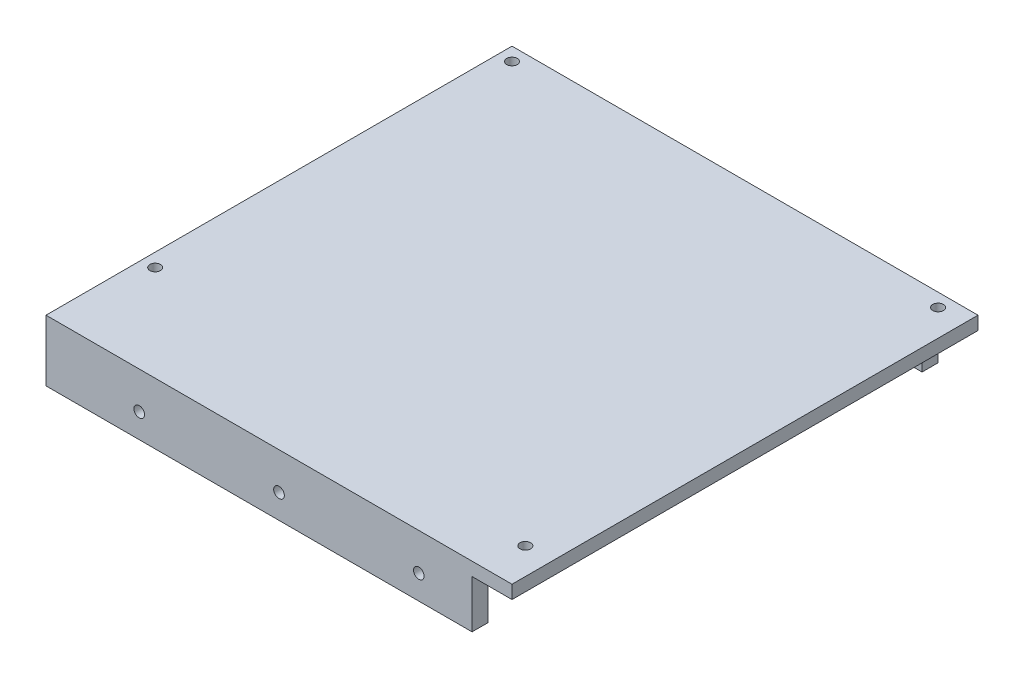
ISO-10303-21;
HEADER;
FILE_DESCRIPTION(('STEP AP214'),'2;1');
FILE_NAME('part.step','',(''),(''),'','','');
FILE_SCHEMA(('AUTOMOTIVE_DESIGN { 1 0 10303 214 1 1 1 1 }'));
ENDSEC;
DATA;
#1=APPLICATION_CONTEXT('core data for automotive mechanical design processes');
#2=APPLICATION_PROTOCOL_DEFINITION('international standard','automotive_design',2000,#1);
#3=PRODUCT_CONTEXT('',#1,'mechanical');
#4=PRODUCT('Part','Part','',(#3));
#5=PRODUCT_RELATED_PRODUCT_CATEGORY('part','',(#4));
#6=PRODUCT_DEFINITION_FORMATION('','',#4);
#7=PRODUCT_DEFINITION_CONTEXT('part definition',#1,'design');
#8=PRODUCT_DEFINITION('design','',#6,#7);
#9=PRODUCT_DEFINITION_SHAPE('','',#8);
#10=(LENGTH_UNIT() NAMED_UNIT(*) SI_UNIT(.MILLI.,.METRE.));
#11=(NAMED_UNIT(*) PLANE_ANGLE_UNIT() SI_UNIT($,.RADIAN.));
#12=(NAMED_UNIT(*) SI_UNIT($,.STERADIAN.) SOLID_ANGLE_UNIT());
#13=UNCERTAINTY_MEASURE_WITH_UNIT(LENGTH_MEASURE(1.E-05),#10,'distance_accuracy_value','');
#14=(GEOMETRIC_REPRESENTATION_CONTEXT(3) GLOBAL_UNCERTAINTY_ASSIGNED_CONTEXT((#13)) GLOBAL_UNIT_ASSIGNED_CONTEXT((#10,
#11,#12)) REPRESENTATION_CONTEXT('',''));
#15=CARTESIAN_POINT('',(0.,0.,0.));
#16=DIRECTION('',(0.,0.,1.));
#17=DIRECTION('',(1.,0.,0.));
#18=AXIS2_PLACEMENT_3D('',#15,#16,#17);
#19=CARTESIAN_POINT('',(-76.5458015267176,-8.90083287186272,114.885496183206));
#20=DIRECTION('',(0.,0.,-1.));
#21=DIRECTION('',(-1.,0.,0.));
#22=AXIS2_PLACEMENT_3D('',#19,#20,#21);
#23=CYLINDRICAL_SURFACE('',#22,2.);
#24=CARTESIAN_POINT('',(-76.5458015267176,-8.90083287186272,-54.1145038167939));
#25=DIRECTION('',(0.,0.,-1.));
#26=DIRECTION('',(-1.,0.,0.));
#27=AXIS2_PLACEMENT_3D('',#24,#25,#26);
#28=CIRCLE('',#27,2.);
#29=CARTESIAN_POINT('',(-78.5458015267176,-8.90083287186272,-54.1145038167939));
#30=VERTEX_POINT('',#29);
#31=EDGE_CURVE('E221',#30,#30,#28,.T.);
#32=ORIENTED_EDGE('',*,*,#31,.F.);
#33=EDGE_LOOP('',(#32));
#34=FACE_BOUND('',#33,.T.);
#35=CARTESIAN_POINT('',(-76.5458015267176,-8.90083287186272,-57.6145038167939));
#36=DIRECTION('',(0.,0.,-1.));
#37=DIRECTION('',(-1.,0.,0.));
#38=AXIS2_PLACEMENT_3D('',#35,#36,#37);
#39=CIRCLE('',#38,2.);
#40=CARTESIAN_POINT('',(-78.5458015267176,-8.90083287186272,-57.6145038167939));
#41=VERTEX_POINT('',#40);
#42=EDGE_CURVE('E41',#41,#41,#39,.F.);
#43=ORIENTED_EDGE('',*,*,#42,.F.);
#44=EDGE_LOOP('',(#43));
#45=FACE_BOUND('',#44,.T.);
#46=ADVANCED_FACE('F37',(#34,#45),#23,.F.);
#47=CARTESIAN_POINT('',(-24.0458015267176,-8.90083287186272,114.885496183206));
#48=DIRECTION('',(0.,0.,-1.));
#49=DIRECTION('',(-1.,0.,0.));
#50=AXIS2_PLACEMENT_3D('',#47,#48,#49);
#51=CYLINDRICAL_SURFACE('',#50,2.);
#52=CARTESIAN_POINT('',(-24.0458015267176,-8.90083287186272,-54.1145038167939));
#53=DIRECTION('',(0.,0.,-1.));
#54=DIRECTION('',(-1.,0.,0.));
#55=AXIS2_PLACEMENT_3D('',#52,#53,#54);
#56=CIRCLE('',#55,2.);
#57=CARTESIAN_POINT('',(-26.0458015267176,-8.90083287186272,-54.1145038167939));
#58=VERTEX_POINT('',#57);
#59=EDGE_CURVE('E226',#58,#58,#56,.T.);
#60=ORIENTED_EDGE('',*,*,#59,.F.);
#61=EDGE_LOOP('',(#60));
#62=FACE_BOUND('',#61,.T.);
#63=CARTESIAN_POINT('',(-24.0458015267176,-8.90083287186272,-57.6145038167939));
#64=DIRECTION('',(0.,0.,-1.));
#65=DIRECTION('',(-1.,0.,0.));
#66=AXIS2_PLACEMENT_3D('',#63,#64,#65);
#67=CIRCLE('',#66,2.);
#68=CARTESIAN_POINT('',(-26.0458015267176,-8.90083287186272,-57.6145038167939));
#69=VERTEX_POINT('',#68);
#70=EDGE_CURVE('E236',#69,#69,#67,.F.);
#71=ORIENTED_EDGE('',*,*,#70,.F.);
#72=EDGE_LOOP('',(#71));
#73=FACE_BOUND('',#72,.T.);
#74=ADVANCED_FACE('F313',(#62,#73),#51,.F.);
#75=CARTESIAN_POINT('',(28.4541984732824,-8.90083287186272,114.885496183206));
#76=DIRECTION('',(0.,0.,-1.));
#77=DIRECTION('',(-1.,0.,0.));
#78=AXIS2_PLACEMENT_3D('',#75,#76,#77);
#79=CYLINDRICAL_SURFACE('',#78,2.);
#80=CARTESIAN_POINT('',(28.4541984732824,-8.90083287186272,-54.1145038167939));
#81=DIRECTION('',(0.,0.,-1.));
#82=DIRECTION('',(-1.,0.,0.));
#83=AXIS2_PLACEMENT_3D('',#80,#81,#82);
#84=CIRCLE('',#83,2.);
#85=CARTESIAN_POINT('',(26.4541984732824,-8.90083287186272,-54.1145038167939));
#86=VERTEX_POINT('',#85);
#87=EDGE_CURVE('E230',#86,#86,#84,.T.);
#88=ORIENTED_EDGE('',*,*,#87,.F.);
#89=EDGE_LOOP('',(#88));
#90=FACE_BOUND('',#89,.T.);
#91=CARTESIAN_POINT('',(28.4541984732824,-8.90083287186272,-57.6145038167939));
#92=DIRECTION('',(0.,0.,-1.));
#93=DIRECTION('',(-1.,0.,0.));
#94=AXIS2_PLACEMENT_3D('',#91,#92,#93);
#95=CIRCLE('',#94,2.);
#96=CARTESIAN_POINT('',(26.4541984732824,-8.90083287186272,-57.6145038167939));
#97=VERTEX_POINT('',#96);
#98=EDGE_CURVE('E234',#97,#97,#95,.F.);
#99=ORIENTED_EDGE('',*,*,#98,.F.);
#100=EDGE_LOOP('',(#99));
#101=FACE_BOUND('',#100,.T.);
#102=ADVANCED_FACE('F320',(#90,#101),#79,.F.);
#103=CARTESIAN_POINT('',(0.,0.,0.));
#104=DIRECTION('',(0.,1.,0.));
#105=DIRECTION('',(0.,0.,1.));
#106=AXIS2_PLACEMENT_3D('',#103,#104,#105);
#107=PLANE('',#106);
#108=CARTESIAN_POINT('',(-106.545801526718,0.,78.8854961832061));
#109=DIRECTION('',(0.,1.,0.));
#110=DIRECTION('',(0.,0.,1.));
#111=AXIS2_PLACEMENT_3D('',#108,#109,#110);
#112=CIRCLE('',#111,2.);
#113=CARTESIAN_POINT('',(-106.545801526718,0.,80.8854961832061));
#114=VERTEX_POINT('',#113);
#115=EDGE_CURVE('E185',#114,#114,#112,.T.);
#116=ORIENTED_EDGE('',*,*,#115,.T.);
#117=EDGE_LOOP('',(#116));
#118=FACE_BOUND('',#117,.T.);
#119=CARTESIAN_POINT('',(53.4541984732824,0.,99.8854961832061));
#120=DIRECTION('',(0.,1.,0.));
#121=DIRECTION('',(0.,0.,1.));
#122=AXIS2_PLACEMENT_3D('',#119,#120,#121);
#123=CIRCLE('',#122,2.);
#124=CARTESIAN_POINT('',(53.4541984732824,0.,101.885496183206));
#125=VERTEX_POINT('',#124);
#126=EDGE_CURVE('E179',#125,#125,#123,.T.);
#127=ORIENTED_EDGE('',*,*,#126,.T.);
#128=EDGE_LOOP('',(#127));
#129=FACE_BOUND('',#128,.T.);
#130=CARTESIAN_POINT('',(53.4541984732824,0.,-55.1145038167939));
#131=DIRECTION('',(0.,1.,0.));
#132=DIRECTION('',(0.,0.,1.));
#133=AXIS2_PLACEMENT_3D('',#130,#131,#132);
#134=CIRCLE('',#133,2.);
#135=CARTESIAN_POINT('',(53.4541984732824,0.,-53.1145038167939));
#136=VERTEX_POINT('',#135);
#137=EDGE_CURVE('E172',#136,#136,#134,.T.);
#138=ORIENTED_EDGE('',*,*,#137,.T.);
#139=EDGE_LOOP('',(#138));
#140=FACE_BOUND('',#139,.T.);
#141=CARTESIAN_POINT('',(-106.545801526718,0.,-55.1145038167939));
#142=DIRECTION('',(0.,1.,0.));
#143=DIRECTION('',(0.,0.,1.));
#144=AXIS2_PLACEMENT_3D('',#141,#142,#143);
#145=CIRCLE('',#144,2.);
#146=CARTESIAN_POINT('',(-106.545801526718,0.,-53.1145038167939));
#147=VERTEX_POINT('',#146);
#148=EDGE_CURVE('E190',#147,#147,#145,.T.);
#149=ORIENTED_EDGE('',*,*,#148,.T.);
#150=EDGE_LOOP('',(#149));
#151=FACE_BOUND('',#150,.T.);
#152=DIRECTION('',(0.,0.,-1.));
#153=VECTOR('',#152,1.);
#154=CARTESIAN_POINT('',(-96.5458015267176,0.,-60.1145038167939));
#155=LINE('',#154,#153);
#156=CARTESIAN_POINT('',(-96.5458015267176,0.,-54.1145038167939));
#157=VERTEX_POINT('',#156);
#158=CARTESIAN_POINT('',(-96.5458015267176,0.,-60.1145038167939));
#159=VERTEX_POINT('',#158);
#160=EDGE_CURVE('E54',#157,#159,#155,.T.);
#161=ORIENTED_EDGE('',*,*,#160,.F.);
#162=DIRECTION('',(-1.,0.,0.));
#163=VECTOR('',#162,1.);
#164=CARTESIAN_POINT('',(-96.5458015267176,0.,-54.1145038167939));
#165=LINE('',#164,#163);
#166=CARTESIAN_POINT('',(48.4541984732824,0.,-54.1145038167939));
#167=VERTEX_POINT('',#166);
#168=EDGE_CURVE('E139',#167,#157,#165,.T.);
#169=ORIENTED_EDGE('',*,*,#168,.F.);
#170=DIRECTION('',(0.,0.,1.));
#171=VECTOR('',#170,1.);
#172=CARTESIAN_POINT('',(48.4541984732824,0.,-60.1145038167939));
#173=LINE('',#172,#171);
#174=CARTESIAN_POINT('',(48.4541984732824,0.,-60.1145038167939));
#175=VERTEX_POINT('',#174);
#176=EDGE_CURVE('E264',#175,#167,#173,.T.);
#177=ORIENTED_EDGE('',*,*,#176,.F.);
#178=DIRECTION('',(-1.,0.,0.));
#179=VECTOR('',#178,1.);
#180=CARTESIAN_POINT('',(-111.545801526718,0.,-60.1145038167939));
#181=LINE('',#180,#179);
#182=CARTESIAN_POINT('',(63.4541984732824,0.,-60.1145038167939));
#183=VERTEX_POINT('',#182);
#184=EDGE_CURVE('E200',#183,#175,#181,.T.);
#185=ORIENTED_EDGE('',*,*,#184,.F.);
#186=DIRECTION('',(0.,0.,-1.));
#187=VECTOR('',#186,1.);
#188=CARTESIAN_POINT('',(63.4541984732824,0.,-60.1145038167939));
#189=LINE('',#188,#187);
#190=CARTESIAN_POINT('',(63.4541984732824,0.,114.885496183206));
#191=VERTEX_POINT('',#190);
#192=EDGE_CURVE('E210',#191,#183,#189,.T.);
#193=ORIENTED_EDGE('',*,*,#192,.F.);
#194=DIRECTION('',(1.,0.,0.));
#195=VECTOR('',#194,1.);
#196=CARTESIAN_POINT('',(-111.545801526718,0.,114.885496183206));
#197=LINE('',#196,#195);
#198=CARTESIAN_POINT('',(48.4541984732824,0.,114.885496183206));
#199=VERTEX_POINT('',#198);
#200=EDGE_CURVE('E62',#199,#191,#197,.T.);
#201=ORIENTED_EDGE('',*,*,#200,.F.);
#202=DIRECTION('',(0.,0.,1.));
#203=VECTOR('',#202,1.);
#204=CARTESIAN_POINT('',(48.4541984732824,0.,114.885496183206));
#205=LINE('',#204,#203);
#206=CARTESIAN_POINT('',(48.4541984732824,0.,108.885496183206));
#207=VERTEX_POINT('',#206);
#208=EDGE_CURVE('E145',#207,#199,#205,.T.);
#209=ORIENTED_EDGE('',*,*,#208,.F.);
#210=DIRECTION('',(1.,0.,0.));
#211=VECTOR('',#210,1.);
#212=CARTESIAN_POINT('',(-111.545801526718,0.,108.885496183206));
#213=LINE('',#212,#211);
#214=CARTESIAN_POINT('',(-111.545801526718,0.,108.885496183206));
#215=VERTEX_POINT('',#214);
#216=EDGE_CURVE('E142',#215,#207,#213,.T.);
#217=ORIENTED_EDGE('',*,*,#216,.F.);
#218=DIRECTION('',(0.,0.,1.));
#219=VECTOR('',#218,1.);
#220=CARTESIAN_POINT('',(-111.545801526718,0.,-60.1145038167939));
#221=LINE('',#220,#219);
#222=CARTESIAN_POINT('',(-111.545801526718,0.,-60.1145038167939));
#223=VERTEX_POINT('',#222);
#224=EDGE_CURVE('E193',#223,#215,#221,.T.);
#225=ORIENTED_EDGE('',*,*,#224,.F.);
#226=EDGE_CURVE('E212',#159,#223,#181,.T.);
#227=ORIENTED_EDGE('',*,*,#226,.F.);
#228=EDGE_LOOP('',(#161,#169,#177,#185,#193,#201,#209,#217,#225,#227));
#229=FACE_BOUND('',#228,.T.);
#230=ADVANCED_FACE('F274',(#118,#129,#140,#151,#229),#107,.F.);
#231=CARTESIAN_POINT('',(-111.545801526718,5.,-60.1145038167939));
#232=DIRECTION('',(1.,0.,0.));
#233=DIRECTION('',(0.,0.,-1.));
#234=AXIS2_PLACEMENT_3D('',#231,#232,#233);
#235=PLANE('',#234);
#236=ORIENTED_EDGE('',*,*,#224,.T.);
#237=DIRECTION('',(0.,1.,0.));
#238=VECTOR('',#237,1.);
#239=CARTESIAN_POINT('',(-111.545801526718,-18.,108.885496183206));
#240=LINE('',#239,#238);
#241=CARTESIAN_POINT('',(-111.545801526718,-18.,108.885496183206));
#242=VERTEX_POINT('',#241);
#243=EDGE_CURVE('E168',#242,#215,#240,.T.);
#244=ORIENTED_EDGE('',*,*,#243,.F.);
#245=DIRECTION('',(0.,0.,-1.));
#246=VECTOR('',#245,1.);
#247=CARTESIAN_POINT('',(-111.545801526718,-18.,114.885496183206));
#248=LINE('',#247,#246);
#249=CARTESIAN_POINT('',(-111.545801526718,-18.,114.885496183206));
#250=VERTEX_POINT('',#249);
#251=EDGE_CURVE('E151',#250,#242,#248,.T.);
#252=ORIENTED_EDGE('',*,*,#251,.F.);
#253=DIRECTION('',(0.,-1.,0.));
#254=VECTOR('',#253,1.);
#255=CARTESIAN_POINT('',(-111.545801526718,5.,114.885496183206));
#256=LINE('',#255,#254);
#257=CARTESIAN_POINT('',(-111.545801526718,5.,114.885496183206));
#258=VERTEX_POINT('',#257);
#259=EDGE_CURVE('E11',#258,#250,#256,.T.);
#260=ORIENTED_EDGE('',*,*,#259,.F.);
#261=DIRECTION('',(0.,0.,1.));
#262=VECTOR('',#261,1.);
#263=CARTESIAN_POINT('',(-111.545801526718,5.,-60.1145038167939));
#264=LINE('',#263,#262);
#265=CARTESIAN_POINT('',(-111.545801526718,5.,-60.1145038167939));
#266=VERTEX_POINT('',#265);
#267=EDGE_CURVE('E196',#266,#258,#264,.T.);
#268=ORIENTED_EDGE('',*,*,#267,.F.);
#269=DIRECTION('',(0.,-1.,0.));
#270=VECTOR('',#269,1.);
#271=CARTESIAN_POINT('',(-111.545801526718,5.,-60.1145038167939));
#272=LINE('',#271,#270);
#273=EDGE_CURVE('E206',#266,#223,#272,.T.);
#274=ORIENTED_EDGE('',*,*,#273,.T.);
#275=EDGE_LOOP('',(#236,#244,#252,#260,#268,#274));
#276=FACE_BOUND('',#275,.T.);
#277=ADVANCED_FACE('F39',(#276),#235,.F.);
#278=CARTESIAN_POINT('',(-111.545801526718,5.,114.885496183206));
#279=DIRECTION('',(0.,0.,-1.));
#280=DIRECTION('',(-1.,0.,0.));
#281=AXIS2_PLACEMENT_3D('',#278,#279,#280);
#282=PLANE('',#281);
#283=CARTESIAN_POINT('',(28.4541984732824,-8.90083287186272,114.885496183206));
#284=DIRECTION('',(0.,0.,-1.));
#285=DIRECTION('',(-1.,0.,0.));
#286=AXIS2_PLACEMENT_3D('',#283,#284,#285);
#287=CIRCLE('',#286,2.);
#288=CARTESIAN_POINT('',(26.4541984732824,-8.90083287186272,114.885496183206));
#289=VERTEX_POINT('',#288);
#290=EDGE_CURVE('E225',#289,#289,#287,.T.);
#291=ORIENTED_EDGE('',*,*,#290,.T.);
#292=EDGE_LOOP('',(#291));
#293=FACE_BOUND('',#292,.T.);
#294=CARTESIAN_POINT('',(-24.0458015267176,-8.90083287186272,114.885496183206));
#295=DIRECTION('',(0.,0.,-1.));
#296=DIRECTION('',(-1.,0.,0.));
#297=AXIS2_PLACEMENT_3D('',#294,#295,#296);
#298=CIRCLE('',#297,2.);
#299=CARTESIAN_POINT('',(-26.0458015267176,-8.90083287186272,114.885496183206));
#300=VERTEX_POINT('',#299);
#301=EDGE_CURVE('E246',#300,#300,#298,.T.);
#302=ORIENTED_EDGE('',*,*,#301,.T.);
#303=EDGE_LOOP('',(#302));
#304=FACE_BOUND('',#303,.T.);
#305=CARTESIAN_POINT('',(-76.5458015267176,-8.90083287186272,114.885496183206));
#306=DIRECTION('',(0.,0.,-1.));
#307=DIRECTION('',(-1.,0.,0.));
#308=AXIS2_PLACEMENT_3D('',#305,#306,#307);
#309=CIRCLE('',#308,2.);
#310=CARTESIAN_POINT('',(-78.5458015267176,-8.90083287186272,114.885496183206));
#311=VERTEX_POINT('',#310);
#312=EDGE_CURVE('E242',#311,#311,#309,.T.);
#313=ORIENTED_EDGE('',*,*,#312,.T.);
#314=EDGE_LOOP('',(#313));
#315=FACE_BOUND('',#314,.T.);
#316=ORIENTED_EDGE('',*,*,#259,.T.);
#317=DIRECTION('',(-1.,0.,0.));
#318=VECTOR('',#317,1.);
#319=CARTESIAN_POINT('',(-111.545801526718,-18.,114.885496183206));
#320=LINE('',#319,#318);
#321=CARTESIAN_POINT('',(48.4541984732824,-18.,114.885496183206));
#322=VERTEX_POINT('',#321);
#323=EDGE_CURVE('E158',#322,#250,#320,.T.);
#324=ORIENTED_EDGE('',*,*,#323,.F.);
#325=DIRECTION('',(0.,1.,0.));
#326=VECTOR('',#325,1.);
#327=CARTESIAN_POINT('',(48.4541984732824,-18.,114.885496183206));
#328=LINE('',#327,#326);
#329=EDGE_CURVE('E160',#322,#199,#328,.T.);
#330=ORIENTED_EDGE('',*,*,#329,.T.);
#331=ORIENTED_EDGE('',*,*,#200,.T.);
#332=DIRECTION('',(0.,-1.,0.));
#333=VECTOR('',#332,1.);
#334=CARTESIAN_POINT('',(63.4541984732824,5.,114.885496183206));
#335=LINE('',#334,#333);
#336=CARTESIAN_POINT('',(63.4541984732824,5.,114.885496183206));
#337=VERTEX_POINT('',#336);
#338=EDGE_CURVE('E46',#337,#191,#335,.T.);
#339=ORIENTED_EDGE('',*,*,#338,.F.);
#340=DIRECTION('',(1.,0.,0.));
#341=VECTOR('',#340,1.);
#342=CARTESIAN_POINT('',(-111.545801526718,5.,114.885496183206));
#343=LINE('',#342,#341);
#344=EDGE_CURVE('E199',#258,#337,#343,.T.);
#345=ORIENTED_EDGE('',*,*,#344,.F.);
#346=EDGE_LOOP('',(#316,#324,#330,#331,#339,#345));
#347=FACE_BOUND('',#346,.T.);
#348=ADVANCED_FACE('F292',(#293,#304,#315,#347),#282,.F.);
#349=CARTESIAN_POINT('',(63.4541984732824,5.,-60.1145038167939));
#350=DIRECTION('',(-1.,0.,0.));
#351=DIRECTION('',(0.,0.,1.));
#352=AXIS2_PLACEMENT_3D('',#349,#350,#351);
#353=PLANE('',#352);
#354=ORIENTED_EDGE('',*,*,#192,.T.);
#355=DIRECTION('',(0.,-1.,0.));
#356=VECTOR('',#355,1.);
#357=CARTESIAN_POINT('',(63.4541984732824,5.,-60.1145038167939));
#358=LINE('',#357,#356);
#359=CARTESIAN_POINT('',(63.4541984732824,5.,-60.1145038167939));
#360=VERTEX_POINT('',#359);
#361=EDGE_CURVE('E216',#360,#183,#358,.T.);
#362=ORIENTED_EDGE('',*,*,#361,.F.);
#363=DIRECTION('',(0.,0.,-1.));
#364=VECTOR('',#363,1.);
#365=CARTESIAN_POINT('',(63.4541984732824,5.,-60.1145038167939));
#366=LINE('',#365,#364);
#367=EDGE_CURVE('E202',#337,#360,#366,.T.);
#368=ORIENTED_EDGE('',*,*,#367,.F.);
#369=ORIENTED_EDGE('',*,*,#338,.T.);
#370=EDGE_LOOP('',(#354,#362,#368,#369));
#371=FACE_BOUND('',#370,.T.);
#372=ADVANCED_FACE('F290',(#371),#353,.F.);
#373=CARTESIAN_POINT('',(-111.545801526718,5.,-60.1145038167939));
#374=DIRECTION('',(0.,0.,1.));
#375=DIRECTION('',(1.,0.,0.));
#376=AXIS2_PLACEMENT_3D('',#373,#374,#375);
#377=PLANE('',#376);
#378=CARTESIAN_POINT('',(28.4541984732824,-8.90083287186272,-60.1145038167939));
#379=DIRECTION('',(0.,0.,-1.));
#380=DIRECTION('',(-1.,0.,0.));
#381=AXIS2_PLACEMENT_3D('',#378,#379,#380);
#382=CIRCLE('',#381,5.);
#383=CARTESIAN_POINT('',(23.4541984732824,-8.90083287186272,-60.1145038167939));
#384=VERTEX_POINT('',#383);
#385=EDGE_CURVE('E396',#384,#384,#382,.T.);
#386=ORIENTED_EDGE('',*,*,#385,.F.);
#387=EDGE_LOOP('',(#386));
#388=FACE_BOUND('',#387,.T.);
#389=CARTESIAN_POINT('',(-24.0458015267176,-8.90083287186272,-60.1145038167939));
#390=DIRECTION('',(0.,0.,-1.));
#391=DIRECTION('',(-1.,0.,0.));
#392=AXIS2_PLACEMENT_3D('',#389,#390,#391);
#393=CIRCLE('',#392,5.);
#394=CARTESIAN_POINT('',(-29.0458015267176,-8.90083287186272,-60.1145038167939));
#395=VERTEX_POINT('',#394);
#396=EDGE_CURVE('E390',#395,#395,#393,.T.);
#397=ORIENTED_EDGE('',*,*,#396,.F.);
#398=EDGE_LOOP('',(#397));
#399=FACE_BOUND('',#398,.T.);
#400=CARTESIAN_POINT('',(-76.5458015267176,-8.90083287186272,-60.1145038167939));
#401=DIRECTION('',(0.,0.,-1.));
#402=DIRECTION('',(-1.,0.,0.));
#403=AXIS2_PLACEMENT_3D('',#400,#401,#402);
#404=CIRCLE('',#403,5.);
#405=CARTESIAN_POINT('',(-81.5458015267176,-8.90083287186272,-60.1145038167939));
#406=VERTEX_POINT('',#405);
#407=EDGE_CURVE('E384',#406,#406,#404,.T.);
#408=ORIENTED_EDGE('',*,*,#407,.F.);
#409=EDGE_LOOP('',(#408));
#410=FACE_BOUND('',#409,.T.);
#411=ORIENTED_EDGE('',*,*,#184,.T.);
#412=DIRECTION('',(0.,1.,0.));
#413=VECTOR('',#412,1.);
#414=CARTESIAN_POINT('',(48.4541984732824,-18.,-60.1145038167939));
#415=LINE('',#414,#413);
#416=CARTESIAN_POINT('',(48.4541984732824,-18.,-60.1145038167939));
#417=VERTEX_POINT('',#416);
#418=EDGE_CURVE('E128',#417,#175,#415,.T.);
#419=ORIENTED_EDGE('',*,*,#418,.F.);
#420=DIRECTION('',(1.,0.,0.));
#421=VECTOR('',#420,1.);
#422=CARTESIAN_POINT('',(-96.5458015267176,-18.,-60.1145038167939));
#423=LINE('',#422,#421);
#424=CARTESIAN_POINT('',(-96.5458015267176,-18.,-60.1145038167939));
#425=VERTEX_POINT('',#424);
#426=EDGE_CURVE('E122',#425,#417,#423,.T.);
#427=ORIENTED_EDGE('',*,*,#426,.F.);
#428=DIRECTION('',(0.,1.,0.));
#429=VECTOR('',#428,1.);
#430=CARTESIAN_POINT('',(-96.5458015267176,-18.,-60.1145038167939));
#431=LINE('',#430,#429);
#432=EDGE_CURVE('E126',#425,#159,#431,.T.);
#433=ORIENTED_EDGE('',*,*,#432,.T.);
#434=ORIENTED_EDGE('',*,*,#226,.T.);
#435=ORIENTED_EDGE('',*,*,#273,.F.);
#436=DIRECTION('',(-1.,0.,0.));
#437=VECTOR('',#436,1.);
#438=CARTESIAN_POINT('',(-111.545801526718,5.,-60.1145038167939));
#439=LINE('',#438,#437);
#440=EDGE_CURVE('E204',#360,#266,#439,.T.);
#441=ORIENTED_EDGE('',*,*,#440,.F.);
#442=ORIENTED_EDGE('',*,*,#361,.T.);
#443=EDGE_LOOP('',(#411,#419,#427,#433,#434,#435,#441,#442));
#444=FACE_BOUND('',#443,.T.);
#445=ADVANCED_FACE('F125',(#388,#399,#410,#444),#377,.F.);
#446=CARTESIAN_POINT('',(0.,5.,0.));
#447=DIRECTION('',(0.,1.,0.));
#448=DIRECTION('',(0.,0.,1.));
#449=AXIS2_PLACEMENT_3D('',#446,#447,#448);
#450=PLANE('',#449);
#451=CARTESIAN_POINT('',(-106.545801526718,5.,78.8854961832061));
#452=DIRECTION('',(0.,1.,0.));
#453=DIRECTION('',(0.,0.,1.));
#454=AXIS2_PLACEMENT_3D('',#451,#452,#453);
#455=CIRCLE('',#454,2.);
#456=CARTESIAN_POINT('',(-106.545801526718,5.,80.8854961832061));
#457=VERTEX_POINT('',#456);
#458=EDGE_CURVE('E171',#457,#457,#455,.T.);
#459=ORIENTED_EDGE('',*,*,#458,.F.);
#460=EDGE_LOOP('',(#459));
#461=FACE_BOUND('',#460,.T.);
#462=CARTESIAN_POINT('',(53.4541984732824,5.,99.8854961832061));
#463=DIRECTION('',(0.,1.,0.));
#464=DIRECTION('',(0.,0.,1.));
#465=AXIS2_PLACEMENT_3D('',#462,#463,#464);
#466=CIRCLE('',#465,2.);
#467=CARTESIAN_POINT('',(53.4541984732824,5.,101.885496183206));
#468=VERTEX_POINT('',#467);
#469=EDGE_CURVE('E182',#468,#468,#466,.T.);
#470=ORIENTED_EDGE('',*,*,#469,.F.);
#471=EDGE_LOOP('',(#470));
#472=FACE_BOUND('',#471,.T.);
#473=CARTESIAN_POINT('',(53.4541984732824,5.,-55.1145038167939));
#474=DIRECTION('',(0.,1.,0.));
#475=DIRECTION('',(0.,0.,1.));
#476=AXIS2_PLACEMENT_3D('',#473,#474,#475);
#477=CIRCLE('',#476,2.);
#478=CARTESIAN_POINT('',(53.4541984732824,5.,-53.1145038167939));
#479=VERTEX_POINT('',#478);
#480=EDGE_CURVE('E176',#479,#479,#477,.T.);
#481=ORIENTED_EDGE('',*,*,#480,.F.);
#482=EDGE_LOOP('',(#481));
#483=FACE_BOUND('',#482,.T.);
#484=CARTESIAN_POINT('',(-106.545801526718,5.,-55.1145038167939));
#485=DIRECTION('',(0.,1.,0.));
#486=DIRECTION('',(0.,0.,1.));
#487=AXIS2_PLACEMENT_3D('',#484,#485,#486);
#488=CIRCLE('',#487,2.);
#489=CARTESIAN_POINT('',(-106.545801526718,5.,-53.1145038167939));
#490=VERTEX_POINT('',#489);
#491=EDGE_CURVE('E175',#490,#490,#488,.T.);
#492=ORIENTED_EDGE('',*,*,#491,.F.);
#493=EDGE_LOOP('',(#492));
#494=FACE_BOUND('',#493,.T.);
#495=ORIENTED_EDGE('',*,*,#267,.T.);
#496=ORIENTED_EDGE('',*,*,#344,.T.);
#497=ORIENTED_EDGE('',*,*,#367,.T.);
#498=ORIENTED_EDGE('',*,*,#440,.T.);
#499=EDGE_LOOP('',(#495,#496,#497,#498));
#500=FACE_BOUND('',#499,.T.);
#501=ADVANCED_FACE('F285',(#461,#472,#483,#494,#500),#450,.T.);
#502=CARTESIAN_POINT('',(-106.545801526718,0.,-55.1145038167939));
#503=DIRECTION('',(0.,1.,0.));
#504=DIRECTION('',(0.,0.,1.));
#505=AXIS2_PLACEMENT_3D('',#502,#503,#504);
#506=CYLINDRICAL_SURFACE('',#505,2.);
#507=ORIENTED_EDGE('',*,*,#148,.F.);
#508=EDGE_LOOP('',(#507));
#509=FACE_BOUND('',#508,.T.);
#510=ORIENTED_EDGE('',*,*,#491,.T.);
#511=EDGE_LOOP('',(#510));
#512=FACE_BOUND('',#511,.T.);
#513=ADVANCED_FACE('F353',(#509,#512),#506,.F.);
#514=CARTESIAN_POINT('',(53.4541984732824,0.,-55.1145038167939));
#515=DIRECTION('',(0.,1.,0.));
#516=DIRECTION('',(0.,0.,1.));
#517=AXIS2_PLACEMENT_3D('',#514,#515,#516);
#518=CYLINDRICAL_SURFACE('',#517,2.);
#519=ORIENTED_EDGE('',*,*,#137,.F.);
#520=EDGE_LOOP('',(#519));
#521=FACE_BOUND('',#520,.T.);
#522=ORIENTED_EDGE('',*,*,#480,.T.);
#523=EDGE_LOOP('',(#522));
#524=FACE_BOUND('',#523,.T.);
#525=ADVANCED_FACE('F350',(#521,#524),#518,.F.);
#526=CARTESIAN_POINT('',(53.4541984732824,0.,99.8854961832061));
#527=DIRECTION('',(0.,1.,0.));
#528=DIRECTION('',(0.,0.,1.));
#529=AXIS2_PLACEMENT_3D('',#526,#527,#528);
#530=CYLINDRICAL_SURFACE('',#529,2.);
#531=ORIENTED_EDGE('',*,*,#126,.F.);
#532=EDGE_LOOP('',(#531));
#533=FACE_BOUND('',#532,.T.);
#534=ORIENTED_EDGE('',*,*,#469,.T.);
#535=EDGE_LOOP('',(#534));
#536=FACE_BOUND('',#535,.T.);
#537=ADVANCED_FACE('F345',(#533,#536),#530,.F.);
#538=CARTESIAN_POINT('',(-106.545801526718,0.,78.8854961832061));
#539=DIRECTION('',(0.,1.,0.));
#540=DIRECTION('',(0.,0.,1.));
#541=AXIS2_PLACEMENT_3D('',#538,#539,#540);
#542=CYLINDRICAL_SURFACE('',#541,2.);
#543=ORIENTED_EDGE('',*,*,#115,.F.);
#544=EDGE_LOOP('',(#543));
#545=FACE_BOUND('',#544,.T.);
#546=ORIENTED_EDGE('',*,*,#458,.T.);
#547=EDGE_LOOP('',(#546));
#548=FACE_BOUND('',#547,.T.);
#549=ADVANCED_FACE('F339',(#545,#548),#542,.F.);
#550=CARTESIAN_POINT('',(-111.545801526718,-18.,108.885496183206));
#551=DIRECTION('',(0.,0.,1.));
#552=DIRECTION('',(1.,0.,0.));
#553=AXIS2_PLACEMENT_3D('',#550,#551,#552);
#554=PLANE('',#553);
#555=CARTESIAN_POINT('',(28.4541984732824,-8.90083287186272,108.885496183206));
#556=DIRECTION('',(0.,0.,1.));
#557=DIRECTION('',(1.,0.,0.));
#558=AXIS2_PLACEMENT_3D('',#555,#556,#557);
#559=CIRCLE('',#558,2.);
#560=CARTESIAN_POINT('',(30.4541984732824,-8.90083287186272,108.885496183206));
#561=VERTEX_POINT('',#560);
#562=EDGE_CURVE('E233',#561,#561,#559,.T.);
#563=ORIENTED_EDGE('',*,*,#562,.T.);
#564=EDGE_LOOP('',(#563));
#565=FACE_BOUND('',#564,.T.);
#566=CARTESIAN_POINT('',(-24.0458015267176,-8.90083287186272,108.885496183206));
#567=DIRECTION('',(0.,0.,1.));
#568=DIRECTION('',(1.,0.,0.));
#569=AXIS2_PLACEMENT_3D('',#566,#567,#568);
#570=CIRCLE('',#569,2.);
#571=CARTESIAN_POINT('',(-22.0458015267176,-8.90083287186272,108.885496183206));
#572=VERTEX_POINT('',#571);
#573=EDGE_CURVE('E229',#572,#572,#570,.T.);
#574=ORIENTED_EDGE('',*,*,#573,.T.);
#575=EDGE_LOOP('',(#574));
#576=FACE_BOUND('',#575,.T.);
#577=CARTESIAN_POINT('',(-76.5458015267176,-8.90083287186272,108.885496183206));
#578=DIRECTION('',(0.,0.,1.));
#579=DIRECTION('',(1.,0.,0.));
#580=AXIS2_PLACEMENT_3D('',#577,#578,#579);
#581=CIRCLE('',#580,2.);
#582=CARTESIAN_POINT('',(-74.5458015267176,-8.90083287186272,108.885496183206));
#583=VERTEX_POINT('',#582);
#584=EDGE_CURVE('E224',#583,#583,#581,.T.);
#585=ORIENTED_EDGE('',*,*,#584,.T.);
#586=EDGE_LOOP('',(#585));
#587=FACE_BOUND('',#586,.T.);
#588=ORIENTED_EDGE('',*,*,#216,.T.);
#589=DIRECTION('',(0.,1.,0.));
#590=VECTOR('',#589,1.);
#591=CARTESIAN_POINT('',(48.4541984732824,-18.,108.885496183206));
#592=LINE('',#591,#590);
#593=CARTESIAN_POINT('',(48.4541984732824,-18.,108.885496183206));
#594=VERTEX_POINT('',#593);
#595=EDGE_CURVE('E165',#594,#207,#592,.T.);
#596=ORIENTED_EDGE('',*,*,#595,.F.);
#597=DIRECTION('',(1.,0.,0.));
#598=VECTOR('',#597,1.);
#599=CARTESIAN_POINT('',(-111.545801526718,-18.,108.885496183206));
#600=LINE('',#599,#598);
#601=EDGE_CURVE('E154',#242,#594,#600,.T.);
#602=ORIENTED_EDGE('',*,*,#601,.F.);
#603=ORIENTED_EDGE('',*,*,#243,.T.);
#604=EDGE_LOOP('',(#588,#596,#602,#603));
#605=FACE_BOUND('',#604,.T.);
#606=ADVANCED_FACE('F300',(#565,#576,#587,#605),#554,.F.);
#607=CARTESIAN_POINT('',(48.4541984732824,-18.,114.885496183206));
#608=DIRECTION('',(-1.,0.,0.));
#609=DIRECTION('',(0.,0.,1.));
#610=AXIS2_PLACEMENT_3D('',#607,#608,#609);
#611=PLANE('',#610);
#612=ORIENTED_EDGE('',*,*,#208,.T.);
#613=ORIENTED_EDGE('',*,*,#329,.F.);
#614=DIRECTION('',(0.,0.,1.));
#615=VECTOR('',#614,1.);
#616=CARTESIAN_POINT('',(48.4541984732824,-18.,114.885496183206));
#617=LINE('',#616,#615);
#618=EDGE_CURVE('E156',#594,#322,#617,.T.);
#619=ORIENTED_EDGE('',*,*,#618,.F.);
#620=ORIENTED_EDGE('',*,*,#595,.T.);
#621=EDGE_LOOP('',(#612,#613,#619,#620));
#622=FACE_BOUND('',#621,.T.);
#623=ADVANCED_FACE('F297',(#622),#611,.F.);
#624=CARTESIAN_POINT('',(0.,-18.,0.));
#625=DIRECTION('',(0.,-1.,0.));
#626=DIRECTION('',(0.,0.,-1.));
#627=AXIS2_PLACEMENT_3D('',#624,#625,#626);
#628=PLANE('',#627);
#629=ORIENTED_EDGE('',*,*,#251,.T.);
#630=ORIENTED_EDGE('',*,*,#601,.T.);
#631=ORIENTED_EDGE('',*,*,#618,.T.);
#632=ORIENTED_EDGE('',*,*,#323,.T.);
#633=EDGE_LOOP('',(#629,#630,#631,#632));
#634=FACE_BOUND('',#633,.T.);
#635=ADVANCED_FACE('F302',(#634),#628,.T.);
#636=CARTESIAN_POINT('',(-96.5458015267176,-18.,-60.1145038167939));
#637=DIRECTION('',(1.,0.,0.));
#638=DIRECTION('',(0.,0.,-1.));
#639=AXIS2_PLACEMENT_3D('',#636,#637,#638);
#640=PLANE('',#639);
#641=ORIENTED_EDGE('',*,*,#160,.T.);
#642=ORIENTED_EDGE('',*,*,#432,.F.);
#643=DIRECTION('',(0.,0.,-1.));
#644=VECTOR('',#643,1.);
#645=CARTESIAN_POINT('',(-96.5458015267176,-18.,-60.1145038167939));
#646=LINE('',#645,#644);
#647=CARTESIAN_POINT('',(-96.5458015267176,-18.,-54.1145038167939));
#648=VERTEX_POINT('',#647);
#649=EDGE_CURVE('E132',#648,#425,#646,.T.);
#650=ORIENTED_EDGE('',*,*,#649,.F.);
#651=DIRECTION('',(0.,1.,0.));
#652=VECTOR('',#651,1.);
#653=CARTESIAN_POINT('',(-96.5458015267176,-18.,-54.1145038167939));
#654=LINE('',#653,#652);
#655=EDGE_CURVE('E262',#648,#157,#654,.T.);
#656=ORIENTED_EDGE('',*,*,#655,.T.);
#657=EDGE_LOOP('',(#641,#642,#650,#656));
#658=FACE_BOUND('',#657,.T.);
#659=ADVANCED_FACE('F141',(#658),#640,.F.);
#660=CARTESIAN_POINT('',(48.4541984732824,-18.,-60.1145038167939));
#661=DIRECTION('',(-1.,0.,0.));
#662=DIRECTION('',(0.,0.,1.));
#663=AXIS2_PLACEMENT_3D('',#660,#661,#662);
#664=PLANE('',#663);
#665=ORIENTED_EDGE('',*,*,#176,.T.);
#666=DIRECTION('',(0.,1.,0.));
#667=VECTOR('',#666,1.);
#668=CARTESIAN_POINT('',(48.4541984732824,-18.,-54.1145038167939));
#669=LINE('',#668,#667);
#670=CARTESIAN_POINT('',(48.4541984732824,-18.,-54.1145038167939));
#671=VERTEX_POINT('',#670);
#672=EDGE_CURVE('E147',#671,#167,#669,.T.);
#673=ORIENTED_EDGE('',*,*,#672,.F.);
#674=DIRECTION('',(0.,0.,1.));
#675=VECTOR('',#674,1.);
#676=CARTESIAN_POINT('',(48.4541984732824,-18.,-60.1145038167939));
#677=LINE('',#676,#675);
#678=EDGE_CURVE('E131',#417,#671,#677,.T.);
#679=ORIENTED_EDGE('',*,*,#678,.F.);
#680=ORIENTED_EDGE('',*,*,#418,.T.);
#681=EDGE_LOOP('',(#665,#673,#679,#680));
#682=FACE_BOUND('',#681,.T.);
#683=ADVANCED_FACE('F309',(#682),#664,.F.);
#684=CARTESIAN_POINT('',(-96.5458015267176,-18.,-54.1145038167939));
#685=DIRECTION('',(0.,0.,-1.));
#686=DIRECTION('',(-1.,0.,0.));
#687=AXIS2_PLACEMENT_3D('',#684,#685,#686);
#688=PLANE('',#687);
#689=ORIENTED_EDGE('',*,*,#87,.T.);
#690=EDGE_LOOP('',(#689));
#691=FACE_BOUND('',#690,.T.);
#692=ORIENTED_EDGE('',*,*,#59,.T.);
#693=EDGE_LOOP('',(#692));
#694=FACE_BOUND('',#693,.T.);
#695=ORIENTED_EDGE('',*,*,#31,.T.);
#696=EDGE_LOOP('',(#695));
#697=FACE_BOUND('',#696,.T.);
#698=ORIENTED_EDGE('',*,*,#168,.T.);
#699=ORIENTED_EDGE('',*,*,#655,.F.);
#700=DIRECTION('',(-1.,0.,0.));
#701=VECTOR('',#700,1.);
#702=CARTESIAN_POINT('',(-96.5458015267176,-18.,-54.1145038167939));
#703=LINE('',#702,#701);
#704=EDGE_CURVE('E137',#671,#648,#703,.T.);
#705=ORIENTED_EDGE('',*,*,#704,.F.);
#706=ORIENTED_EDGE('',*,*,#672,.T.);
#707=EDGE_LOOP('',(#698,#699,#705,#706));
#708=FACE_BOUND('',#707,.T.);
#709=ADVANCED_FACE('F271',(#691,#694,#697,#708),#688,.F.);
#710=CARTESIAN_POINT('',(0.,-18.,0.));
#711=DIRECTION('',(0.,1.,0.));
#712=DIRECTION('',(0.,0.,1.));
#713=AXIS2_PLACEMENT_3D('',#710,#711,#712);
#714=PLANE('',#713);
#715=ORIENTED_EDGE('',*,*,#649,.T.);
#716=ORIENTED_EDGE('',*,*,#426,.T.);
#717=ORIENTED_EDGE('',*,*,#678,.T.);
#718=ORIENTED_EDGE('',*,*,#704,.T.);
#719=EDGE_LOOP('',(#715,#716,#717,#718));
#720=FACE_BOUND('',#719,.T.);
#721=ADVANCED_FACE('F135',(#720),#714,.F.);
#722=ORIENTED_EDGE('',*,*,#312,.F.);
#723=EDGE_LOOP('',(#722));
#724=FACE_BOUND('',#723,.T.);
#725=ORIENTED_EDGE('',*,*,#584,.F.);
#726=EDGE_LOOP('',(#725));
#727=FACE_BOUND('',#726,.T.);
#728=ADVANCED_FACE('F316',(#724,#727),#23,.F.);
#729=ORIENTED_EDGE('',*,*,#301,.F.);
#730=EDGE_LOOP('',(#729));
#731=FACE_BOUND('',#730,.T.);
#732=ORIENTED_EDGE('',*,*,#573,.F.);
#733=EDGE_LOOP('',(#732));
#734=FACE_BOUND('',#733,.T.);
#735=ADVANCED_FACE('F323',(#731,#734),#51,.F.);
#736=ORIENTED_EDGE('',*,*,#290,.F.);
#737=EDGE_LOOP('',(#736));
#738=FACE_BOUND('',#737,.T.);
#739=ORIENTED_EDGE('',*,*,#562,.F.);
#740=EDGE_LOOP('',(#739));
#741=FACE_BOUND('',#740,.T.);
#742=ADVANCED_FACE('F333',(#738,#741),#79,.F.);
#743=CARTESIAN_POINT('',(28.4541984732824,-8.90083287186272,-57.6145038167939));
#744=DIRECTION('',(0.,0.,-1.));
#745=DIRECTION('',(-1.,0.,0.));
#746=AXIS2_PLACEMENT_3D('',#743,#744,#745);
#747=PLANE('',#746);
#748=CARTESIAN_POINT('',(28.4541984732824,-8.90083287186272,-57.6145038167939));
#749=DIRECTION('',(0.,0.,-1.));
#750=DIRECTION('',(-1.,0.,0.));
#751=AXIS2_PLACEMENT_3D('',#748,#749,#750);
#752=CIRCLE('',#751,5.);
#753=CARTESIAN_POINT('',(23.4541984732824,-8.90083287186272,-57.6145038167939));
#754=VERTEX_POINT('',#753);
#755=EDGE_CURVE('E237',#754,#754,#752,.T.);
#756=ORIENTED_EDGE('',*,*,#755,.T.);
#757=EDGE_LOOP('',(#756));
#758=FACE_BOUND('',#757,.T.);
#759=ORIENTED_EDGE('',*,*,#98,.T.);
#760=EDGE_LOOP('',(#759));
#761=FACE_BOUND('',#760,.T.);
#762=ADVANCED_FACE('F402',(#758,#761),#747,.T.);
#763=CARTESIAN_POINT('',(28.4541984732824,-8.90083287186272,-57.6145038167939));
#764=DIRECTION('',(0.,0.,-1.));
#765=DIRECTION('',(-1.,0.,0.));
#766=AXIS2_PLACEMENT_3D('',#763,#764,#765);
#767=CYLINDRICAL_SURFACE('',#766,5.);
#768=ORIENTED_EDGE('',*,*,#755,.F.);
#769=EDGE_LOOP('',(#768));
#770=FACE_BOUND('',#769,.T.);
#771=ORIENTED_EDGE('',*,*,#385,.T.);
#772=EDGE_LOOP('',(#771));
#773=FACE_BOUND('',#772,.T.);
#774=ADVANCED_FACE('F405',(#770,#773),#767,.F.);
#775=CARTESIAN_POINT('',(-24.0458015267176,-8.90083287186272,-57.6145038167939));
#776=DIRECTION('',(0.,0.,-1.));
#777=DIRECTION('',(-1.,0.,0.));
#778=AXIS2_PLACEMENT_3D('',#775,#776,#777);
#779=PLANE('',#778);
#780=CARTESIAN_POINT('',(-24.0458015267176,-8.90083287186272,-57.6145038167939));
#781=DIRECTION('',(0.,0.,-1.));
#782=DIRECTION('',(-1.,0.,0.));
#783=AXIS2_PLACEMENT_3D('',#780,#781,#782);
#784=CIRCLE('',#783,5.);
#785=CARTESIAN_POINT('',(-29.0458015267176,-8.90083287186272,-57.6145038167939));
#786=VERTEX_POINT('',#785);
#787=EDGE_CURVE('E393',#786,#786,#784,.T.);
#788=ORIENTED_EDGE('',*,*,#787,.T.);
#789=EDGE_LOOP('',(#788));
#790=FACE_BOUND('',#789,.T.);
#791=ORIENTED_EDGE('',*,*,#70,.T.);
#792=EDGE_LOOP('',(#791));
#793=FACE_BOUND('',#792,.T.);
#794=ADVANCED_FACE('F408',(#790,#793),#779,.T.);
#795=CARTESIAN_POINT('',(-24.0458015267176,-8.90083287186272,-57.6145038167939));
#796=DIRECTION('',(0.,0.,-1.));
#797=DIRECTION('',(-1.,0.,0.));
#798=AXIS2_PLACEMENT_3D('',#795,#796,#797);
#799=CYLINDRICAL_SURFACE('',#798,5.);
#800=ORIENTED_EDGE('',*,*,#787,.F.);
#801=EDGE_LOOP('',(#800));
#802=FACE_BOUND('',#801,.T.);
#803=ORIENTED_EDGE('',*,*,#396,.T.);
#804=EDGE_LOOP('',(#803));
#805=FACE_BOUND('',#804,.T.);
#806=ADVANCED_FACE('F424',(#802,#805),#799,.F.);
#807=CARTESIAN_POINT('',(-76.5458015267176,-8.90083287186272,-57.6145038167939));
#808=DIRECTION('',(0.,0.,-1.));
#809=DIRECTION('',(-1.,0.,0.));
#810=AXIS2_PLACEMENT_3D('',#807,#808,#809);
#811=PLANE('',#810);
#812=CARTESIAN_POINT('',(-76.5458015267176,-8.90083287186272,-57.6145038167939));
#813=DIRECTION('',(0.,0.,-1.));
#814=DIRECTION('',(-1.,0.,0.));
#815=AXIS2_PLACEMENT_3D('',#812,#813,#814);
#816=CIRCLE('',#815,5.);
#817=CARTESIAN_POINT('',(-81.5458015267176,-8.90083287186272,-57.6145038167939));
#818=VERTEX_POINT('',#817);
#819=EDGE_CURVE('E387',#818,#818,#816,.T.);
#820=ORIENTED_EDGE('',*,*,#819,.T.);
#821=EDGE_LOOP('',(#820));
#822=FACE_BOUND('',#821,.T.);
#823=ORIENTED_EDGE('',*,*,#42,.T.);
#824=EDGE_LOOP('',(#823));
#825=FACE_BOUND('',#824,.T.);
#826=ADVANCED_FACE('F418',(#822,#825),#811,.T.);
#827=CARTESIAN_POINT('',(-76.5458015267176,-8.90083287186272,-57.6145038167939));
#828=DIRECTION('',(0.,0.,-1.));
#829=DIRECTION('',(-1.,0.,0.));
#830=AXIS2_PLACEMENT_3D('',#827,#828,#829);
#831=CYLINDRICAL_SURFACE('',#830,5.);
#832=ORIENTED_EDGE('',*,*,#819,.F.);
#833=EDGE_LOOP('',(#832));
#834=FACE_BOUND('',#833,.T.);
#835=ORIENTED_EDGE('',*,*,#407,.T.);
#836=EDGE_LOOP('',(#835));
#837=FACE_BOUND('',#836,.T.);
#838=ADVANCED_FACE('F416',(#834,#837),#831,.F.);
#839=CLOSED_SHELL('',(#46,#74,#102,#230,#277,#348,#372,#445,#501,#513,#525,#537,#549,#606,#623,
#635,#659,#683,#709,#721,#728,#735,#742,#762,#774,#794,#806,#826,#838));
#840=MANIFOLD_SOLID_BREP('B2',#839);
#841=ADVANCED_BREP_SHAPE_REPRESENTATION('',(#18,#840),#14);
#842=SHAPE_DEFINITION_REPRESENTATION(#9,#841);
ENDSEC;
END-ISO-10303-21;
